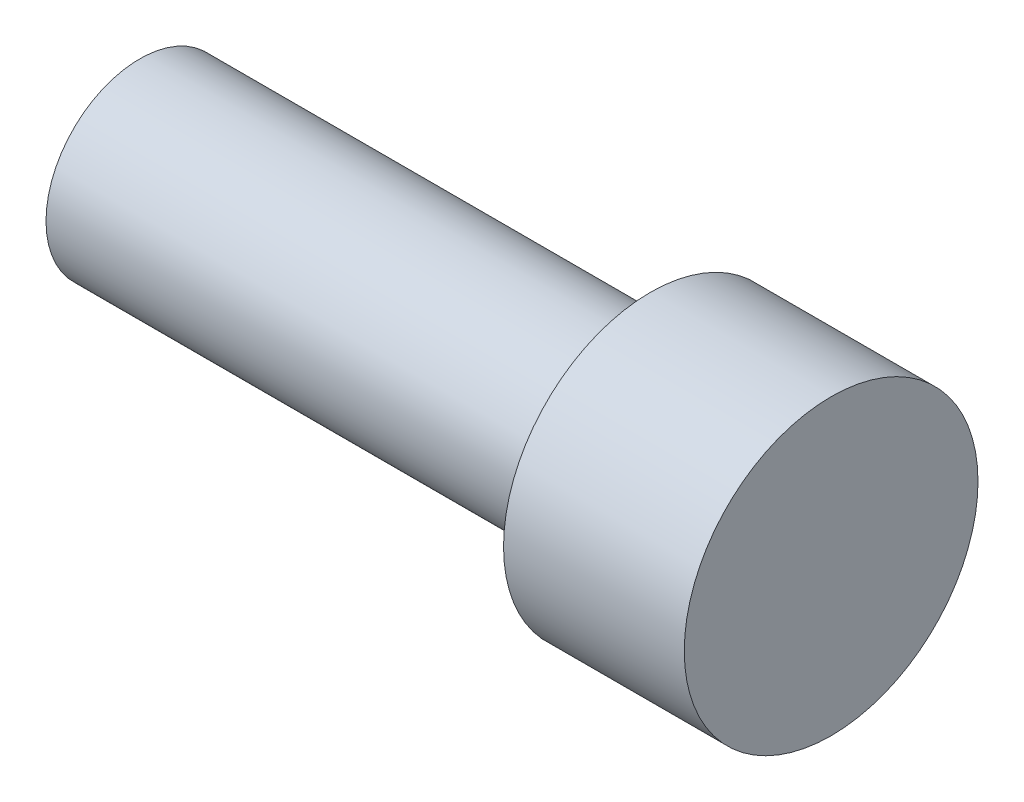
ISO-10303-21;
HEADER;
FILE_DESCRIPTION(('STEP AP214'),'2;1');
FILE_NAME('part.step','',(''),(''),'','','');
FILE_SCHEMA(('AUTOMOTIVE_DESIGN { 1 0 10303 214 1 1 1 1 }'));
ENDSEC;
DATA;
#1=APPLICATION_CONTEXT('core data for automotive mechanical design processes');
#2=APPLICATION_PROTOCOL_DEFINITION('international standard','automotive_design',2000,#1);
#3=PRODUCT_CONTEXT('',#1,'mechanical');
#4=PRODUCT('Part','Part','',(#3));
#5=PRODUCT_RELATED_PRODUCT_CATEGORY('part','',(#4));
#6=PRODUCT_DEFINITION_FORMATION('','',#4);
#7=PRODUCT_DEFINITION_CONTEXT('part definition',#1,'design');
#8=PRODUCT_DEFINITION('design','',#6,#7);
#9=PRODUCT_DEFINITION_SHAPE('','',#8);
#10=(LENGTH_UNIT() NAMED_UNIT(*) SI_UNIT(.MILLI.,.METRE.));
#11=(NAMED_UNIT(*) PLANE_ANGLE_UNIT() SI_UNIT($,.RADIAN.));
#12=(NAMED_UNIT(*) SI_UNIT($,.STERADIAN.) SOLID_ANGLE_UNIT());
#13=UNCERTAINTY_MEASURE_WITH_UNIT(LENGTH_MEASURE(1.E-05),#10,'distance_accuracy_value','');
#14=(GEOMETRIC_REPRESENTATION_CONTEXT(3) GLOBAL_UNCERTAINTY_ASSIGNED_CONTEXT((#13)) GLOBAL_UNIT_ASSIGNED_CONTEXT((#10,
#11,#12)) REPRESENTATION_CONTEXT('',''));
#15=CARTESIAN_POINT('',(0.,0.,0.));
#16=DIRECTION('',(0.,0.,1.));
#17=DIRECTION('',(1.,0.,0.));
#18=AXIS2_PLACEMENT_3D('',#15,#16,#17);
#19=CARTESIAN_POINT('',(11.3,0.,0.));
#20=DIRECTION('',(-1.,0.,0.));
#21=DIRECTION('',(0.,0.,1.));
#22=AXIS2_PLACEMENT_3D('',#19,#20,#21);
#23=CYLINDRICAL_SURFACE('',#22,2.075);
#24=CARTESIAN_POINT('',(11.3,0.,0.));
#25=DIRECTION('',(1.,0.,0.));
#26=DIRECTION('',(0.,0.,-1.));
#27=AXIS2_PLACEMENT_3D('',#24,#25,#26);
#28=CIRCLE('',#27,2.075);
#29=CARTESIAN_POINT('',(11.3,0.,-2.075));
#30=VERTEX_POINT('',#29);
#31=EDGE_CURVE('E10',#30,#30,#28,.T.);
#32=ORIENTED_EDGE('',*,*,#31,.F.);
#33=EDGE_LOOP('',(#32));
#34=FACE_BOUND('',#33,.T.);
#35=CARTESIAN_POINT('',(0.,0.,0.));
#36=DIRECTION('',(1.,0.,0.));
#37=DIRECTION('',(0.,0.,-1.));
#38=AXIS2_PLACEMENT_3D('',#35,#36,#37);
#39=CIRCLE('',#38,2.075);
#40=CARTESIAN_POINT('',(0.,0.,-2.075));
#41=VERTEX_POINT('',#40);
#42=EDGE_CURVE('E33',#41,#41,#39,.T.);
#43=ORIENTED_EDGE('',*,*,#42,.T.);
#44=EDGE_LOOP('',(#43));
#45=FACE_BOUND('',#44,.T.);
#46=ADVANCED_FACE('F30',(#34,#45),#23,.T.);
#47=CARTESIAN_POINT('',(0.,0.,0.));
#48=DIRECTION('',(1.,0.,0.));
#49=DIRECTION('',(0.,0.,-1.));
#50=AXIS2_PLACEMENT_3D('',#47,#48,#49);
#51=PLANE('',#50);
#52=ORIENTED_EDGE('',*,*,#42,.F.);
#53=EDGE_LOOP('',(#52));
#54=FACE_BOUND('',#53,.T.);
#55=ADVANCED_FACE('F58',(#54),#51,.F.);
#56=CARTESIAN_POINT('',(11.3,0.,0.));
#57=DIRECTION('',(1.,0.,0.));
#58=DIRECTION('',(0.,0.,-1.));
#59=AXIS2_PLACEMENT_3D('',#56,#57,#58);
#60=PLANE('',#59);
#61=CARTESIAN_POINT('',(11.3,0.,0.));
#62=DIRECTION('',(1.,0.,0.));
#63=DIRECTION('',(0.,0.,-1.));
#64=AXIS2_PLACEMENT_3D('',#61,#62,#63);
#65=CIRCLE('',#64,3.25);
#66=CARTESIAN_POINT('',(11.3,0.,-3.25));
#67=VERTEX_POINT('',#66);
#68=EDGE_CURVE('E42',#67,#67,#65,.T.);
#69=ORIENTED_EDGE('',*,*,#68,.F.);
#70=EDGE_LOOP('',(#69));
#71=FACE_BOUND('',#70,.T.);
#72=ORIENTED_EDGE('',*,*,#31,.T.);
#73=EDGE_LOOP('',(#72));
#74=FACE_BOUND('',#73,.T.);
#75=ADVANCED_FACE('F53',(#71,#74),#60,.F.);
#76=CARTESIAN_POINT('',(15.3,0.,0.));
#77=DIRECTION('',(-1.,0.,0.));
#78=DIRECTION('',(0.,0.,1.));
#79=AXIS2_PLACEMENT_3D('',#76,#77,#78);
#80=CYLINDRICAL_SURFACE('',#79,3.25);
#81=CARTESIAN_POINT('',(15.3,0.,0.));
#82=DIRECTION('',(1.,0.,0.));
#83=DIRECTION('',(0.,0.,-1.));
#84=AXIS2_PLACEMENT_3D('',#81,#82,#83);
#85=CIRCLE('',#84,3.25);
#86=CARTESIAN_POINT('',(15.3,0.,-3.25));
#87=VERTEX_POINT('',#86);
#88=EDGE_CURVE('E40',#87,#87,#85,.T.);
#89=ORIENTED_EDGE('',*,*,#88,.F.);
#90=EDGE_LOOP('',(#89));
#91=FACE_BOUND('',#90,.T.);
#92=ORIENTED_EDGE('',*,*,#68,.T.);
#93=EDGE_LOOP('',(#92));
#94=FACE_BOUND('',#93,.T.);
#95=ADVANCED_FACE('F50',(#91,#94),#80,.T.);
#96=CARTESIAN_POINT('',(15.3,0.,0.));
#97=DIRECTION('',(1.,0.,0.));
#98=DIRECTION('',(0.,0.,-1.));
#99=AXIS2_PLACEMENT_3D('',#96,#97,#98);
#100=PLANE('',#99);
#101=ORIENTED_EDGE('',*,*,#88,.T.);
#102=EDGE_LOOP('',(#101));
#103=FACE_BOUND('',#102,.T.);
#104=ADVANCED_FACE('F48',(#103),#100,.T.);
#105=CLOSED_SHELL('',(#46,#55,#75,#95,#104));
#106=MANIFOLD_SOLID_BREP('B2',#105);
#107=ADVANCED_BREP_SHAPE_REPRESENTATION('',(#18,#106),#14);
#108=SHAPE_DEFINITION_REPRESENTATION(#9,#107);
ENDSEC;
END-ISO-10303-21;
